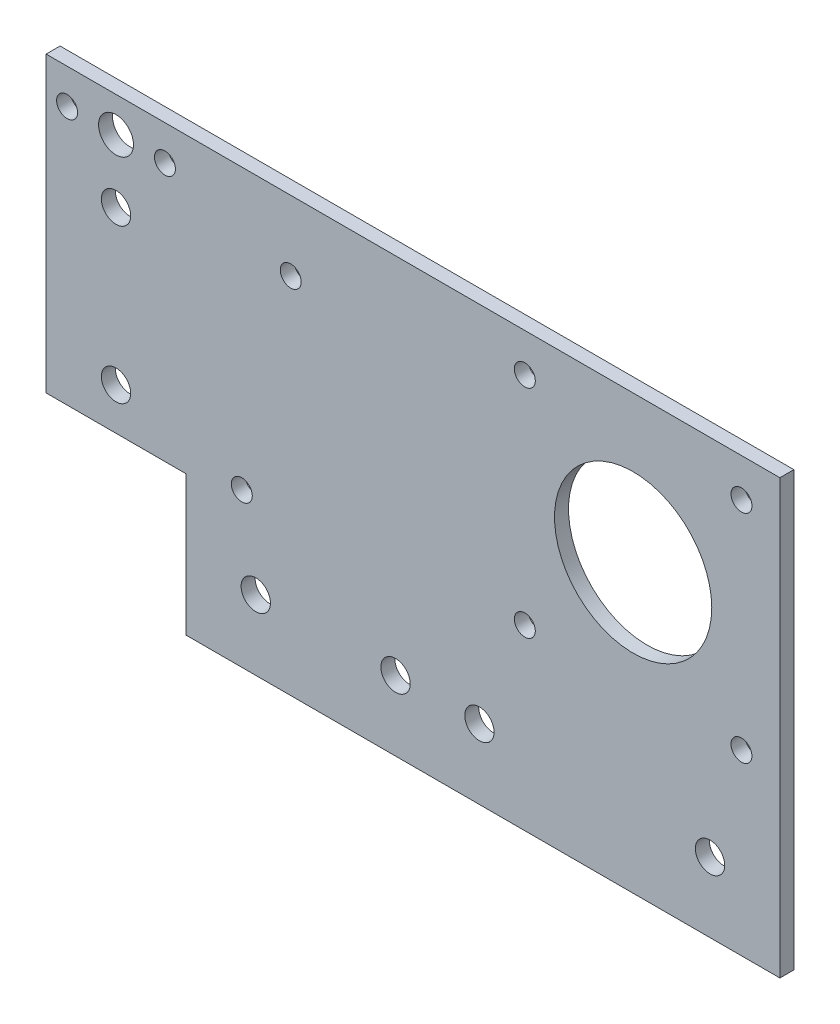
ISO-10303-21;
HEADER;
FILE_DESCRIPTION(('STEP AP214'),'2;1');
FILE_NAME('part.step','',(''),(''),'','','');
FILE_SCHEMA(('AUTOMOTIVE_DESIGN { 1 0 10303 214 1 1 1 1 }'));
ENDSEC;
DATA;
#1=APPLICATION_CONTEXT('core data for automotive mechanical design processes');
#2=APPLICATION_PROTOCOL_DEFINITION('international standard','automotive_design',2000,#1);
#3=PRODUCT_CONTEXT('',#1,'mechanical');
#4=PRODUCT('Part','Part','',(#3));
#5=PRODUCT_RELATED_PRODUCT_CATEGORY('part','',(#4));
#6=PRODUCT_DEFINITION_FORMATION('','',#4);
#7=PRODUCT_DEFINITION_CONTEXT('part definition',#1,'design');
#8=PRODUCT_DEFINITION('design','',#6,#7);
#9=PRODUCT_DEFINITION_SHAPE('','',#8);
#10=(LENGTH_UNIT() NAMED_UNIT(*) SI_UNIT(.MILLI.,.METRE.));
#11=(NAMED_UNIT(*) PLANE_ANGLE_UNIT() SI_UNIT($,.RADIAN.));
#12=(NAMED_UNIT(*) SI_UNIT($,.STERADIAN.) SOLID_ANGLE_UNIT());
#13=UNCERTAINTY_MEASURE_WITH_UNIT(LENGTH_MEASURE(1.E-05),#10,'distance_accuracy_value','');
#14=(GEOMETRIC_REPRESENTATION_CONTEXT(3) GLOBAL_UNCERTAINTY_ASSIGNED_CONTEXT((#13)) GLOBAL_UNIT_ASSIGNED_CONTEXT((#10,
#11,#12)) REPRESENTATION_CONTEXT('',''));
#15=CARTESIAN_POINT('',(0.,0.,0.));
#16=DIRECTION('',(0.,0.,1.));
#17=DIRECTION('',(1.,0.,0.));
#18=AXIS2_PLACEMENT_3D('',#15,#16,#17);
#19=CARTESIAN_POINT('',(0.,0.,2.));
#20=DIRECTION('',(0.,0.,-1.));
#21=DIRECTION('',(-1.,0.,0.));
#22=AXIS2_PLACEMENT_3D('',#19,#20,#21);
#23=PLANE('',#22);
#24=CARTESIAN_POINT('',(50.,-10.,2.));
#25=DIRECTION('',(0.,0.,1.));
#26=DIRECTION('',(1.,0.,0.));
#27=AXIS2_PLACEMENT_3D('',#24,#25,#26);
#28=CIRCLE('',#27,2.1);
#29=CARTESIAN_POINT('',(52.1,-10.,2.));
#30=VERTEX_POINT('',#29);
#31=EDGE_CURVE('E250',#30,#30,#28,.T.);
#32=ORIENTED_EDGE('',*,*,#31,.F.);
#33=EDGE_LOOP('',(#32));
#34=FACE_BOUND('',#33,.T.);
#35=CARTESIAN_POINT('',(95.,-10.,2.));
#36=DIRECTION('',(0.,0.,1.));
#37=DIRECTION('',(1.,0.,0.));
#38=AXIS2_PLACEMENT_3D('',#35,#36,#37);
#39=CIRCLE('',#38,2.1);
#40=CARTESIAN_POINT('',(97.1,-10.,2.));
#41=VERTEX_POINT('',#40);
#42=EDGE_CURVE('E262',#41,#41,#39,.T.);
#43=ORIENTED_EDGE('',*,*,#42,.F.);
#44=EDGE_LOOP('',(#43));
#45=FACE_BOUND('',#44,.T.);
#46=CARTESIAN_POINT('',(10.,6.,2.));
#47=DIRECTION('',(0.,0.,1.));
#48=DIRECTION('',(1.,0.,0.));
#49=AXIS2_PLACEMENT_3D('',#46,#47,#48);
#50=CIRCLE('',#49,2.1);
#51=CARTESIAN_POINT('',(12.1,6.,2.));
#52=VERTEX_POINT('',#51);
#53=EDGE_CURVE('E274',#52,#52,#50,.T.);
#54=ORIENTED_EDGE('',*,*,#53,.F.);
#55=EDGE_LOOP('',(#54));
#56=FACE_BOUND('',#55,.T.);
#57=CARTESIAN_POINT('',(28.,2.,2.));
#58=DIRECTION('',(0.,0.,1.));
#59=DIRECTION('',(1.,0.,0.));
#60=AXIS2_PLACEMENT_3D('',#57,#58,#59);
#61=CIRCLE('',#60,1.5);
#62=CARTESIAN_POINT('',(29.5,2.,2.));
#63=VERTEX_POINT('',#62);
#64=EDGE_CURVE('E286',#63,#63,#61,.T.);
#65=ORIENTED_EDGE('',*,*,#64,.F.);
#66=EDGE_LOOP('',(#65));
#67=FACE_BOUND('',#66,.T.);
#68=CARTESIAN_POINT('',(99.5,5.50000000000001,2.));
#69=DIRECTION('',(0.,0.,1.));
#70=DIRECTION('',(1.,0.,0.));
#71=AXIS2_PLACEMENT_3D('',#68,#69,#70);
#72=CIRCLE('',#71,1.5);
#73=CARTESIAN_POINT('',(101.,5.50000000000001,2.));
#74=VERTEX_POINT('',#73);
#75=EDGE_CURVE('E298',#74,#74,#72,.T.);
#76=ORIENTED_EDGE('',*,*,#75,.F.);
#77=EDGE_LOOP('',(#76));
#78=FACE_BOUND('',#77,.T.);
#79=CARTESIAN_POINT('',(68.5,36.5,2.));
#80=DIRECTION('',(0.,0.,1.));
#81=DIRECTION('',(1.,0.,0.));
#82=AXIS2_PLACEMENT_3D('',#79,#80,#81);
#83=CIRCLE('',#82,1.5);
#84=CARTESIAN_POINT('',(70.,36.5,2.));
#85=VERTEX_POINT('',#84);
#86=EDGE_CURVE('E310',#85,#85,#83,.T.);
#87=ORIENTED_EDGE('',*,*,#86,.F.);
#88=EDGE_LOOP('',(#87));
#89=FACE_BOUND('',#88,.T.);
#90=CARTESIAN_POINT('',(84.,21.,2.));
#91=DIRECTION('',(0.,0.,1.));
#92=DIRECTION('',(1.,0.,0.));
#93=AXIS2_PLACEMENT_3D('',#90,#91,#92);
#94=CIRCLE('',#93,11.25);
#95=CARTESIAN_POINT('',(95.25,21.,2.));
#96=VERTEX_POINT('',#95);
#97=EDGE_CURVE('E322',#96,#96,#94,.T.);
#98=ORIENTED_EDGE('',*,*,#97,.F.);
#99=EDGE_LOOP('',(#98));
#100=FACE_BOUND('',#99,.T.);
#101=CARTESIAN_POINT('',(3.,37.,2.));
#102=DIRECTION('',(0.,0.,1.));
#103=DIRECTION('',(1.,0.,0.));
#104=AXIS2_PLACEMENT_3D('',#101,#102,#103);
#105=CIRCLE('',#104,1.5);
#106=CARTESIAN_POINT('',(4.5,37.,2.));
#107=VERTEX_POINT('',#106);
#108=EDGE_CURVE('E134',#107,#107,#105,.T.);
#109=ORIENTED_EDGE('',*,*,#108,.F.);
#110=EDGE_LOOP('',(#109));
#111=FACE_BOUND('',#110,.T.);
#112=DIRECTION('',(0.,1.,0.));
#113=VECTOR('',#112,1.);
#114=CARTESIAN_POINT('',(105.,-20.,2.));
#115=LINE('',#114,#113);
#116=CARTESIAN_POINT('',(105.,-20.,2.));
#117=VERTEX_POINT('',#116);
#118=CARTESIAN_POINT('',(105.,42.,2.));
#119=VERTEX_POINT('',#118);
#120=EDGE_CURVE('E141',#117,#119,#115,.T.);
#121=ORIENTED_EDGE('',*,*,#120,.T.);
#122=DIRECTION('',(-1.,0.,0.));
#123=VECTOR('',#122,1.);
#124=CARTESIAN_POINT('',(0.,42.,2.));
#125=LINE('',#124,#123);
#126=CARTESIAN_POINT('',(0.,42.,2.));
#127=VERTEX_POINT('',#126);
#128=EDGE_CURVE('E99',#119,#127,#125,.T.);
#129=ORIENTED_EDGE('',*,*,#128,.T.);
#130=DIRECTION('',(0.,-1.,0.));
#131=VECTOR('',#130,1.);
#132=CARTESIAN_POINT('',(0.,0.,2.));
#133=LINE('',#132,#131);
#134=CARTESIAN_POINT('',(0.,0.,2.));
#135=VERTEX_POINT('',#134);
#136=EDGE_CURVE('E112',#127,#135,#133,.T.);
#137=ORIENTED_EDGE('',*,*,#136,.T.);
#138=DIRECTION('',(1.,0.,0.));
#139=VECTOR('',#138,1.);
#140=CARTESIAN_POINT('',(0.,0.,2.));
#141=LINE('',#140,#139);
#142=CARTESIAN_POINT('',(20.,0.,2.));
#143=VERTEX_POINT('',#142);
#144=EDGE_CURVE('E106',#135,#143,#141,.T.);
#145=ORIENTED_EDGE('',*,*,#144,.T.);
#146=DIRECTION('',(0.,-1.,0.));
#147=VECTOR('',#146,1.);
#148=CARTESIAN_POINT('',(20.,0.,2.));
#149=LINE('',#148,#147);
#150=CARTESIAN_POINT('',(20.,-20.,2.));
#151=VERTEX_POINT('',#150);
#152=EDGE_CURVE('E110',#143,#151,#149,.T.);
#153=ORIENTED_EDGE('',*,*,#152,.T.);
#154=DIRECTION('',(1.,0.,0.));
#155=VECTOR('',#154,1.);
#156=CARTESIAN_POINT('',(20.,-20.,2.));
#157=LINE('',#156,#155);
#158=EDGE_CURVE('E62',#151,#117,#157,.T.);
#159=ORIENTED_EDGE('',*,*,#158,.T.);
#160=EDGE_LOOP('',(#121,#129,#137,#145,#153,#159));
#161=FACE_BOUND('',#160,.T.);
#162=CARTESIAN_POINT('',(17.,37.,2.));
#163=DIRECTION('',(0.,0.,1.));
#164=DIRECTION('',(1.,0.,0.));
#165=AXIS2_PLACEMENT_3D('',#162,#163,#164);
#166=CIRCLE('',#165,1.5);
#167=CARTESIAN_POINT('',(18.5,37.,2.));
#168=VERTEX_POINT('',#167);
#169=EDGE_CURVE('E328',#168,#168,#166,.T.);
#170=ORIENTED_EDGE('',*,*,#169,.F.);
#171=EDGE_LOOP('',(#170));
#172=FACE_BOUND('',#171,.T.);
#173=CARTESIAN_POINT('',(99.5,36.5,2.));
#174=DIRECTION('',(0.,0.,1.));
#175=DIRECTION('',(1.,0.,0.));
#176=AXIS2_PLACEMENT_3D('',#173,#174,#175);
#177=CIRCLE('',#176,1.5);
#178=CARTESIAN_POINT('',(101.,36.5,2.));
#179=VERTEX_POINT('',#178);
#180=EDGE_CURVE('E316',#179,#179,#177,.T.);
#181=ORIENTED_EDGE('',*,*,#180,.F.);
#182=EDGE_LOOP('',(#181));
#183=FACE_BOUND('',#182,.T.);
#184=CARTESIAN_POINT('',(68.5,5.50000000000001,2.));
#185=DIRECTION('',(0.,0.,1.));
#186=DIRECTION('',(1.,0.,0.));
#187=AXIS2_PLACEMENT_3D('',#184,#185,#186);
#188=CIRCLE('',#187,1.5);
#189=CARTESIAN_POINT('',(70.,5.50000000000001,2.));
#190=VERTEX_POINT('',#189);
#191=EDGE_CURVE('E304',#190,#190,#188,.T.);
#192=ORIENTED_EDGE('',*,*,#191,.F.);
#193=EDGE_LOOP('',(#192));
#194=FACE_BOUND('',#193,.T.);
#195=CARTESIAN_POINT('',(35.,32.,2.));
#196=DIRECTION('',(0.,0.,1.));
#197=DIRECTION('',(1.,0.,0.));
#198=AXIS2_PLACEMENT_3D('',#195,#196,#197);
#199=CIRCLE('',#198,1.5);
#200=CARTESIAN_POINT('',(36.5,32.,2.));
#201=VERTEX_POINT('',#200);
#202=EDGE_CURVE('E292',#201,#201,#199,.T.);
#203=ORIENTED_EDGE('',*,*,#202,.F.);
#204=EDGE_LOOP('',(#203));
#205=FACE_BOUND('',#204,.T.);
#206=CARTESIAN_POINT('',(10.,28.,2.));
#207=DIRECTION('',(0.,0.,1.));
#208=DIRECTION('',(1.,0.,0.));
#209=AXIS2_PLACEMENT_3D('',#206,#207,#208);
#210=CIRCLE('',#209,2.1);
#211=CARTESIAN_POINT('',(12.1,28.,2.));
#212=VERTEX_POINT('',#211);
#213=EDGE_CURVE('E280',#212,#212,#210,.T.);
#214=ORIENTED_EDGE('',*,*,#213,.F.);
#215=EDGE_LOOP('',(#214));
#216=FACE_BOUND('',#215,.T.);
#217=CARTESIAN_POINT('',(30.,-10.,2.));
#218=DIRECTION('',(0.,0.,1.));
#219=DIRECTION('',(1.,0.,0.));
#220=AXIS2_PLACEMENT_3D('',#217,#218,#219);
#221=CIRCLE('',#220,2.1);
#222=CARTESIAN_POINT('',(32.1,-10.,2.));
#223=VERTEX_POINT('',#222);
#224=EDGE_CURVE('E268',#223,#223,#221,.T.);
#225=ORIENTED_EDGE('',*,*,#224,.F.);
#226=EDGE_LOOP('',(#225));
#227=FACE_BOUND('',#226,.T.);
#228=CARTESIAN_POINT('',(10.,37.,2.));
#229=DIRECTION('',(0.,0.,1.));
#230=DIRECTION('',(1.,0.,0.));
#231=AXIS2_PLACEMENT_3D('',#228,#229,#230);
#232=CIRCLE('',#231,2.5);
#233=CARTESIAN_POINT('',(12.5,37.,2.));
#234=VERTEX_POINT('',#233);
#235=EDGE_CURVE('E256',#234,#234,#232,.T.);
#236=ORIENTED_EDGE('',*,*,#235,.F.);
#237=EDGE_LOOP('',(#236));
#238=FACE_BOUND('',#237,.T.);
#239=CARTESIAN_POINT('',(62.,-10.,2.));
#240=DIRECTION('',(0.,0.,1.));
#241=DIRECTION('',(1.,0.,0.));
#242=AXIS2_PLACEMENT_3D('',#239,#240,#241);
#243=CIRCLE('',#242,2.09999999999999);
#244=CARTESIAN_POINT('',(64.1,-10.,2.));
#245=VERTEX_POINT('',#244);
#246=EDGE_CURVE('E241',#245,#245,#243,.T.);
#247=ORIENTED_EDGE('',*,*,#246,.F.);
#248=EDGE_LOOP('',(#247));
#249=FACE_BOUND('',#248,.T.);
#250=ADVANCED_FACE('F45',(#34,#45,#56,#67,#78,#89,#100,#111,#161,#172,#183,#194,#205,#216,#227,
#238,#249),#23,.F.);
#251=CARTESIAN_POINT('',(0.,0.,0.));
#252=DIRECTION('',(0.,0.,-1.));
#253=DIRECTION('',(-1.,0.,0.));
#254=AXIS2_PLACEMENT_3D('',#251,#252,#253);
#255=PLANE('',#254);
#256=CARTESIAN_POINT('',(50.,-10.,0.));
#257=DIRECTION('',(0.,0.,1.));
#258=DIRECTION('',(1.,0.,0.));
#259=AXIS2_PLACEMENT_3D('',#256,#257,#258);
#260=CIRCLE('',#259,2.1);
#261=CARTESIAN_POINT('',(52.1,-10.,0.));
#262=VERTEX_POINT('',#261);
#263=EDGE_CURVE('E247',#262,#262,#260,.T.);
#264=ORIENTED_EDGE('',*,*,#263,.T.);
#265=EDGE_LOOP('',(#264));
#266=FACE_BOUND('',#265,.T.);
#267=CARTESIAN_POINT('',(95.,-10.,0.));
#268=DIRECTION('',(0.,0.,1.));
#269=DIRECTION('',(1.,0.,0.));
#270=AXIS2_PLACEMENT_3D('',#267,#268,#269);
#271=CIRCLE('',#270,2.1);
#272=CARTESIAN_POINT('',(97.1,-10.,0.));
#273=VERTEX_POINT('',#272);
#274=EDGE_CURVE('E259',#273,#273,#271,.T.);
#275=ORIENTED_EDGE('',*,*,#274,.T.);
#276=EDGE_LOOP('',(#275));
#277=FACE_BOUND('',#276,.T.);
#278=CARTESIAN_POINT('',(10.,6.,0.));
#279=DIRECTION('',(0.,0.,1.));
#280=DIRECTION('',(1.,0.,0.));
#281=AXIS2_PLACEMENT_3D('',#278,#279,#280);
#282=CIRCLE('',#281,2.1);
#283=CARTESIAN_POINT('',(12.1,6.,0.));
#284=VERTEX_POINT('',#283);
#285=EDGE_CURVE('E271',#284,#284,#282,.T.);
#286=ORIENTED_EDGE('',*,*,#285,.T.);
#287=EDGE_LOOP('',(#286));
#288=FACE_BOUND('',#287,.T.);
#289=CARTESIAN_POINT('',(28.,2.,0.));
#290=DIRECTION('',(0.,0.,1.));
#291=DIRECTION('',(1.,0.,0.));
#292=AXIS2_PLACEMENT_3D('',#289,#290,#291);
#293=CIRCLE('',#292,1.5);
#294=CARTESIAN_POINT('',(29.5,2.,0.));
#295=VERTEX_POINT('',#294);
#296=EDGE_CURVE('E283',#295,#295,#293,.T.);
#297=ORIENTED_EDGE('',*,*,#296,.T.);
#298=EDGE_LOOP('',(#297));
#299=FACE_BOUND('',#298,.T.);
#300=CARTESIAN_POINT('',(99.5,5.50000000000001,0.));
#301=DIRECTION('',(0.,0.,1.));
#302=DIRECTION('',(1.,0.,0.));
#303=AXIS2_PLACEMENT_3D('',#300,#301,#302);
#304=CIRCLE('',#303,1.5);
#305=CARTESIAN_POINT('',(101.,5.50000000000001,0.));
#306=VERTEX_POINT('',#305);
#307=EDGE_CURVE('E295',#306,#306,#304,.T.);
#308=ORIENTED_EDGE('',*,*,#307,.T.);
#309=EDGE_LOOP('',(#308));
#310=FACE_BOUND('',#309,.T.);
#311=CARTESIAN_POINT('',(68.5,36.5,0.));
#312=DIRECTION('',(0.,0.,1.));
#313=DIRECTION('',(1.,0.,0.));
#314=AXIS2_PLACEMENT_3D('',#311,#312,#313);
#315=CIRCLE('',#314,1.5);
#316=CARTESIAN_POINT('',(70.,36.5,0.));
#317=VERTEX_POINT('',#316);
#318=EDGE_CURVE('E307',#317,#317,#315,.T.);
#319=ORIENTED_EDGE('',*,*,#318,.T.);
#320=EDGE_LOOP('',(#319));
#321=FACE_BOUND('',#320,.T.);
#322=CARTESIAN_POINT('',(84.,21.,0.));
#323=DIRECTION('',(0.,0.,1.));
#324=DIRECTION('',(1.,0.,0.));
#325=AXIS2_PLACEMENT_3D('',#322,#323,#324);
#326=CIRCLE('',#325,11.25);
#327=CARTESIAN_POINT('',(95.25,21.,0.));
#328=VERTEX_POINT('',#327);
#329=EDGE_CURVE('E319',#328,#328,#326,.T.);
#330=ORIENTED_EDGE('',*,*,#329,.T.);
#331=EDGE_LOOP('',(#330));
#332=FACE_BOUND('',#331,.T.);
#333=CARTESIAN_POINT('',(3.,37.,0.));
#334=DIRECTION('',(0.,0.,1.));
#335=DIRECTION('',(1.,0.,0.));
#336=AXIS2_PLACEMENT_3D('',#333,#334,#335);
#337=CIRCLE('',#336,1.5);
#338=CARTESIAN_POINT('',(4.5,37.,0.));
#339=VERTEX_POINT('',#338);
#340=EDGE_CURVE('E331',#339,#339,#337,.T.);
#341=ORIENTED_EDGE('',*,*,#340,.T.);
#342=EDGE_LOOP('',(#341));
#343=FACE_BOUND('',#342,.T.);
#344=DIRECTION('',(0.,1.,0.));
#345=VECTOR('',#344,1.);
#346=CARTESIAN_POINT('',(105.,-20.,0.));
#347=LINE('',#346,#345);
#348=CARTESIAN_POINT('',(105.,-20.,0.));
#349=VERTEX_POINT('',#348);
#350=CARTESIAN_POINT('',(105.,42.,0.));
#351=VERTEX_POINT('',#350);
#352=EDGE_CURVE('E130',#349,#351,#347,.T.);
#353=ORIENTED_EDGE('',*,*,#352,.F.);
#354=DIRECTION('',(1.,0.,0.));
#355=VECTOR('',#354,1.);
#356=CARTESIAN_POINT('',(20.,-20.,0.));
#357=LINE('',#356,#355);
#358=CARTESIAN_POINT('',(20.,-20.,0.));
#359=VERTEX_POINT('',#358);
#360=EDGE_CURVE('E91',#359,#349,#357,.T.);
#361=ORIENTED_EDGE('',*,*,#360,.F.);
#362=DIRECTION('',(0.,-1.,0.));
#363=VECTOR('',#362,1.);
#364=CARTESIAN_POINT('',(20.,0.,0.));
#365=LINE('',#364,#363);
#366=CARTESIAN_POINT('',(20.,0.,0.));
#367=VERTEX_POINT('',#366);
#368=EDGE_CURVE('E85',#367,#359,#365,.T.);
#369=ORIENTED_EDGE('',*,*,#368,.F.);
#370=DIRECTION('',(1.,0.,0.));
#371=VECTOR('',#370,1.);
#372=CARTESIAN_POINT('',(0.,0.,0.));
#373=LINE('',#372,#371);
#374=CARTESIAN_POINT('',(0.,0.,0.));
#375=VERTEX_POINT('',#374);
#376=EDGE_CURVE('E120',#375,#367,#373,.T.);
#377=ORIENTED_EDGE('',*,*,#376,.F.);
#378=DIRECTION('',(0.,-1.,0.));
#379=VECTOR('',#378,1.);
#380=CARTESIAN_POINT('',(0.,0.,0.));
#381=LINE('',#380,#379);
#382=CARTESIAN_POINT('',(0.,42.,0.));
#383=VERTEX_POINT('',#382);
#384=EDGE_CURVE('E136',#383,#375,#381,.T.);
#385=ORIENTED_EDGE('',*,*,#384,.F.);
#386=DIRECTION('',(-1.,0.,0.));
#387=VECTOR('',#386,1.);
#388=CARTESIAN_POINT('',(0.,42.,0.));
#389=LINE('',#388,#387);
#390=EDGE_CURVE('E133',#351,#383,#389,.T.);
#391=ORIENTED_EDGE('',*,*,#390,.F.);
#392=EDGE_LOOP('',(#353,#361,#369,#377,#385,#391));
#393=FACE_BOUND('',#392,.T.);
#394=CARTESIAN_POINT('',(17.,37.,0.));
#395=DIRECTION('',(0.,0.,1.));
#396=DIRECTION('',(1.,0.,0.));
#397=AXIS2_PLACEMENT_3D('',#394,#395,#396);
#398=CIRCLE('',#397,1.5);
#399=CARTESIAN_POINT('',(18.5,37.,0.));
#400=VERTEX_POINT('',#399);
#401=EDGE_CURVE('E325',#400,#400,#398,.T.);
#402=ORIENTED_EDGE('',*,*,#401,.T.);
#403=EDGE_LOOP('',(#402));
#404=FACE_BOUND('',#403,.T.);
#405=CARTESIAN_POINT('',(99.5,36.5,0.));
#406=DIRECTION('',(0.,0.,1.));
#407=DIRECTION('',(1.,0.,0.));
#408=AXIS2_PLACEMENT_3D('',#405,#406,#407);
#409=CIRCLE('',#408,1.5);
#410=CARTESIAN_POINT('',(101.,36.5,0.));
#411=VERTEX_POINT('',#410);
#412=EDGE_CURVE('E313',#411,#411,#409,.T.);
#413=ORIENTED_EDGE('',*,*,#412,.T.);
#414=EDGE_LOOP('',(#413));
#415=FACE_BOUND('',#414,.T.);
#416=CARTESIAN_POINT('',(68.5,5.50000000000001,0.));
#417=DIRECTION('',(0.,0.,1.));
#418=DIRECTION('',(1.,0.,0.));
#419=AXIS2_PLACEMENT_3D('',#416,#417,#418);
#420=CIRCLE('',#419,1.5);
#421=CARTESIAN_POINT('',(70.,5.50000000000001,0.));
#422=VERTEX_POINT('',#421);
#423=EDGE_CURVE('E301',#422,#422,#420,.T.);
#424=ORIENTED_EDGE('',*,*,#423,.T.);
#425=EDGE_LOOP('',(#424));
#426=FACE_BOUND('',#425,.T.);
#427=CARTESIAN_POINT('',(35.,32.,0.));
#428=DIRECTION('',(0.,0.,1.));
#429=DIRECTION('',(1.,0.,0.));
#430=AXIS2_PLACEMENT_3D('',#427,#428,#429);
#431=CIRCLE('',#430,1.5);
#432=CARTESIAN_POINT('',(36.5,32.,0.));
#433=VERTEX_POINT('',#432);
#434=EDGE_CURVE('E289',#433,#433,#431,.T.);
#435=ORIENTED_EDGE('',*,*,#434,.T.);
#436=EDGE_LOOP('',(#435));
#437=FACE_BOUND('',#436,.T.);
#438=CARTESIAN_POINT('',(10.,28.,0.));
#439=DIRECTION('',(0.,0.,1.));
#440=DIRECTION('',(1.,0.,0.));
#441=AXIS2_PLACEMENT_3D('',#438,#439,#440);
#442=CIRCLE('',#441,2.1);
#443=CARTESIAN_POINT('',(12.1,28.,0.));
#444=VERTEX_POINT('',#443);
#445=EDGE_CURVE('E277',#444,#444,#442,.T.);
#446=ORIENTED_EDGE('',*,*,#445,.T.);
#447=EDGE_LOOP('',(#446));
#448=FACE_BOUND('',#447,.T.);
#449=CARTESIAN_POINT('',(30.,-10.,0.));
#450=DIRECTION('',(0.,0.,1.));
#451=DIRECTION('',(1.,0.,0.));
#452=AXIS2_PLACEMENT_3D('',#449,#450,#451);
#453=CIRCLE('',#452,2.1);
#454=CARTESIAN_POINT('',(32.1,-10.,0.));
#455=VERTEX_POINT('',#454);
#456=EDGE_CURVE('E265',#455,#455,#453,.T.);
#457=ORIENTED_EDGE('',*,*,#456,.T.);
#458=EDGE_LOOP('',(#457));
#459=FACE_BOUND('',#458,.T.);
#460=CARTESIAN_POINT('',(10.,37.,0.));
#461=DIRECTION('',(0.,0.,1.));
#462=DIRECTION('',(1.,0.,0.));
#463=AXIS2_PLACEMENT_3D('',#460,#461,#462);
#464=CIRCLE('',#463,2.5);
#465=CARTESIAN_POINT('',(12.5,37.,0.));
#466=VERTEX_POINT('',#465);
#467=EDGE_CURVE('E253',#466,#466,#464,.T.);
#468=ORIENTED_EDGE('',*,*,#467,.T.);
#469=EDGE_LOOP('',(#468));
#470=FACE_BOUND('',#469,.T.);
#471=CARTESIAN_POINT('',(62.,-10.,0.));
#472=DIRECTION('',(0.,0.,1.));
#473=DIRECTION('',(1.,0.,0.));
#474=AXIS2_PLACEMENT_3D('',#471,#472,#473);
#475=CIRCLE('',#474,2.09999999999999);
#476=CARTESIAN_POINT('',(64.1,-10.,0.));
#477=VERTEX_POINT('',#476);
#478=EDGE_CURVE('E244',#477,#477,#475,.T.);
#479=ORIENTED_EDGE('',*,*,#478,.T.);
#480=EDGE_LOOP('',(#479));
#481=FACE_BOUND('',#480,.T.);
#482=ADVANCED_FACE('F150',(#266,#277,#288,#299,#310,#321,#332,#343,#393,#404,#415,#426,#437,
#448,#459,#470,#481),#255,.T.);
#483=CARTESIAN_POINT('',(105.,-20.,2.));
#484=DIRECTION('',(-1.,0.,0.));
#485=DIRECTION('',(0.,0.,1.));
#486=AXIS2_PLACEMENT_3D('',#483,#484,#485);
#487=PLANE('',#486);
#488=ORIENTED_EDGE('',*,*,#352,.T.);
#489=DIRECTION('',(0.,0.,-1.));
#490=VECTOR('',#489,1.);
#491=CARTESIAN_POINT('',(105.,42.,2.));
#492=LINE('',#491,#490);
#493=EDGE_CURVE('E13',#119,#351,#492,.T.);
#494=ORIENTED_EDGE('',*,*,#493,.F.);
#495=ORIENTED_EDGE('',*,*,#120,.F.);
#496=DIRECTION('',(0.,0.,-1.));
#497=VECTOR('',#496,1.);
#498=CARTESIAN_POINT('',(105.,-20.,2.));
#499=LINE('',#498,#497);
#500=EDGE_CURVE('E126',#117,#349,#499,.T.);
#501=ORIENTED_EDGE('',*,*,#500,.T.);
#502=EDGE_LOOP('',(#488,#494,#495,#501));
#503=FACE_BOUND('',#502,.T.);
#504=ADVANCED_FACE('F47',(#503),#487,.F.);
#505=CARTESIAN_POINT('',(0.,42.,2.));
#506=DIRECTION('',(0.,-1.,0.));
#507=DIRECTION('',(0.,0.,-1.));
#508=AXIS2_PLACEMENT_3D('',#505,#506,#507);
#509=PLANE('',#508);
#510=ORIENTED_EDGE('',*,*,#390,.T.);
#511=DIRECTION('',(0.,0.,-1.));
#512=VECTOR('',#511,1.);
#513=CARTESIAN_POINT('',(0.,42.,2.));
#514=LINE('',#513,#512);
#515=EDGE_CURVE('E54',#127,#383,#514,.T.);
#516=ORIENTED_EDGE('',*,*,#515,.F.);
#517=ORIENTED_EDGE('',*,*,#128,.F.);
#518=ORIENTED_EDGE('',*,*,#493,.T.);
#519=EDGE_LOOP('',(#510,#516,#517,#518));
#520=FACE_BOUND('',#519,.T.);
#521=ADVANCED_FACE('F496',(#520),#509,.F.);
#522=CARTESIAN_POINT('',(0.,0.,2.));
#523=DIRECTION('',(1.,0.,0.));
#524=DIRECTION('',(0.,0.,-1.));
#525=AXIS2_PLACEMENT_3D('',#522,#523,#524);
#526=PLANE('',#525);
#527=ORIENTED_EDGE('',*,*,#384,.T.);
#528=DIRECTION('',(0.,0.,-1.));
#529=VECTOR('',#528,1.);
#530=CARTESIAN_POINT('',(0.,0.,2.));
#531=LINE('',#530,#529);
#532=EDGE_CURVE('E121',#135,#375,#531,.T.);
#533=ORIENTED_EDGE('',*,*,#532,.F.);
#534=ORIENTED_EDGE('',*,*,#136,.F.);
#535=ORIENTED_EDGE('',*,*,#515,.T.);
#536=EDGE_LOOP('',(#527,#533,#534,#535));
#537=FACE_BOUND('',#536,.T.);
#538=ADVANCED_FACE('F147',(#537),#526,.F.);
#539=CARTESIAN_POINT('',(0.,0.,2.));
#540=DIRECTION('',(0.,1.,0.));
#541=DIRECTION('',(0.,0.,1.));
#542=AXIS2_PLACEMENT_3D('',#539,#540,#541);
#543=PLANE('',#542);
#544=ORIENTED_EDGE('',*,*,#376,.T.);
#545=DIRECTION('',(0.,0.,-1.));
#546=VECTOR('',#545,1.);
#547=CARTESIAN_POINT('',(20.,0.,2.));
#548=LINE('',#547,#546);
#549=EDGE_CURVE('E117',#143,#367,#548,.T.);
#550=ORIENTED_EDGE('',*,*,#549,.F.);
#551=ORIENTED_EDGE('',*,*,#144,.F.);
#552=ORIENTED_EDGE('',*,*,#532,.T.);
#553=EDGE_LOOP('',(#544,#550,#551,#552));
#554=FACE_BOUND('',#553,.T.);
#555=ADVANCED_FACE('F118',(#554),#543,.F.);
#556=CARTESIAN_POINT('',(20.,0.,2.));
#557=DIRECTION('',(1.,0.,0.));
#558=DIRECTION('',(0.,1.,0.));
#559=AXIS2_PLACEMENT_3D('',#556,#557,#558);
#560=PLANE('',#559);
#561=ORIENTED_EDGE('',*,*,#368,.T.);
#562=DIRECTION('',(0.,0.,-1.));
#563=VECTOR('',#562,1.);
#564=CARTESIAN_POINT('',(20.,-20.,2.));
#565=LINE('',#564,#563);
#566=EDGE_CURVE('E122',#151,#359,#565,.T.);
#567=ORIENTED_EDGE('',*,*,#566,.F.);
#568=ORIENTED_EDGE('',*,*,#152,.F.);
#569=ORIENTED_EDGE('',*,*,#549,.T.);
#570=EDGE_LOOP('',(#561,#567,#568,#569));
#571=FACE_BOUND('',#570,.T.);
#572=ADVANCED_FACE('F124',(#571),#560,.F.);
#573=CARTESIAN_POINT('',(20.,-20.,2.));
#574=DIRECTION('',(0.,1.,0.));
#575=DIRECTION('',(0.,0.,1.));
#576=AXIS2_PLACEMENT_3D('',#573,#574,#575);
#577=PLANE('',#576);
#578=ORIENTED_EDGE('',*,*,#360,.T.);
#579=ORIENTED_EDGE('',*,*,#500,.F.);
#580=ORIENTED_EDGE('',*,*,#158,.F.);
#581=ORIENTED_EDGE('',*,*,#566,.T.);
#582=EDGE_LOOP('',(#578,#579,#580,#581));
#583=FACE_BOUND('',#582,.T.);
#584=ADVANCED_FACE('F155',(#583),#577,.F.);
#585=CARTESIAN_POINT('',(3.,37.,2.));
#586=DIRECTION('',(0.,0.,-1.));
#587=DIRECTION('',(-1.,0.,0.));
#588=AXIS2_PLACEMENT_3D('',#585,#586,#587);
#589=CYLINDRICAL_SURFACE('',#588,1.5);
#590=ORIENTED_EDGE('',*,*,#108,.T.);
#591=EDGE_LOOP('',(#590));
#592=FACE_BOUND('',#591,.T.);
#593=ORIENTED_EDGE('',*,*,#340,.F.);
#594=EDGE_LOOP('',(#593));
#595=FACE_BOUND('',#594,.T.);
#596=ADVANCED_FACE('F157',(#592,#595),#589,.F.);
#597=CARTESIAN_POINT('',(17.,37.,2.));
#598=DIRECTION('',(0.,0.,-1.));
#599=DIRECTION('',(-1.,0.,0.));
#600=AXIS2_PLACEMENT_3D('',#597,#598,#599);
#601=CYLINDRICAL_SURFACE('',#600,1.5);
#602=ORIENTED_EDGE('',*,*,#169,.T.);
#603=EDGE_LOOP('',(#602));
#604=FACE_BOUND('',#603,.T.);
#605=ORIENTED_EDGE('',*,*,#401,.F.);
#606=EDGE_LOOP('',(#605));
#607=FACE_BOUND('',#606,.T.);
#608=ADVANCED_FACE('F163',(#604,#607),#601,.F.);
#609=CARTESIAN_POINT('',(84.,21.,2.));
#610=DIRECTION('',(0.,0.,-1.));
#611=DIRECTION('',(-1.,0.,0.));
#612=AXIS2_PLACEMENT_3D('',#609,#610,#611);
#613=CYLINDRICAL_SURFACE('',#612,11.25);
#614=ORIENTED_EDGE('',*,*,#97,.T.);
#615=EDGE_LOOP('',(#614));
#616=FACE_BOUND('',#615,.T.);
#617=ORIENTED_EDGE('',*,*,#329,.F.);
#618=EDGE_LOOP('',(#617));
#619=FACE_BOUND('',#618,.T.);
#620=ADVANCED_FACE('F180',(#616,#619),#613,.F.);
#621=CARTESIAN_POINT('',(99.5,36.5,2.));
#622=DIRECTION('',(0.,0.,-1.));
#623=DIRECTION('',(-1.,0.,0.));
#624=AXIS2_PLACEMENT_3D('',#621,#622,#623);
#625=CYLINDRICAL_SURFACE('',#624,1.5);
#626=ORIENTED_EDGE('',*,*,#180,.T.);
#627=EDGE_LOOP('',(#626));
#628=FACE_BOUND('',#627,.T.);
#629=ORIENTED_EDGE('',*,*,#412,.F.);
#630=EDGE_LOOP('',(#629));
#631=FACE_BOUND('',#630,.T.);
#632=ADVANCED_FACE('F184',(#628,#631),#625,.F.);
#633=CARTESIAN_POINT('',(68.5,36.5,2.));
#634=DIRECTION('',(0.,0.,-1.));
#635=DIRECTION('',(-1.,0.,0.));
#636=AXIS2_PLACEMENT_3D('',#633,#634,#635);
#637=CYLINDRICAL_SURFACE('',#636,1.5);
#638=ORIENTED_EDGE('',*,*,#86,.T.);
#639=EDGE_LOOP('',(#638));
#640=FACE_BOUND('',#639,.T.);
#641=ORIENTED_EDGE('',*,*,#318,.F.);
#642=EDGE_LOOP('',(#641));
#643=FACE_BOUND('',#642,.T.);
#644=ADVANCED_FACE('F188',(#640,#643),#637,.F.);
#645=CARTESIAN_POINT('',(68.5,5.50000000000001,2.));
#646=DIRECTION('',(0.,0.,-1.));
#647=DIRECTION('',(-1.,0.,0.));
#648=AXIS2_PLACEMENT_3D('',#645,#646,#647);
#649=CYLINDRICAL_SURFACE('',#648,1.5);
#650=ORIENTED_EDGE('',*,*,#191,.T.);
#651=EDGE_LOOP('',(#650));
#652=FACE_BOUND('',#651,.T.);
#653=ORIENTED_EDGE('',*,*,#423,.F.);
#654=EDGE_LOOP('',(#653));
#655=FACE_BOUND('',#654,.T.);
#656=ADVANCED_FACE('F192',(#652,#655),#649,.F.);
#657=CARTESIAN_POINT('',(99.5,5.50000000000001,2.));
#658=DIRECTION('',(0.,0.,-1.));
#659=DIRECTION('',(-1.,0.,0.));
#660=AXIS2_PLACEMENT_3D('',#657,#658,#659);
#661=CYLINDRICAL_SURFACE('',#660,1.5);
#662=ORIENTED_EDGE('',*,*,#75,.T.);
#663=EDGE_LOOP('',(#662));
#664=FACE_BOUND('',#663,.T.);
#665=ORIENTED_EDGE('',*,*,#307,.F.);
#666=EDGE_LOOP('',(#665));
#667=FACE_BOUND('',#666,.T.);
#668=ADVANCED_FACE('F196',(#664,#667),#661,.F.);
#669=CARTESIAN_POINT('',(35.,32.,2.));
#670=DIRECTION('',(0.,0.,-1.));
#671=DIRECTION('',(-1.,0.,0.));
#672=AXIS2_PLACEMENT_3D('',#669,#670,#671);
#673=CYLINDRICAL_SURFACE('',#672,1.5);
#674=ORIENTED_EDGE('',*,*,#202,.T.);
#675=EDGE_LOOP('',(#674));
#676=FACE_BOUND('',#675,.T.);
#677=ORIENTED_EDGE('',*,*,#434,.F.);
#678=EDGE_LOOP('',(#677));
#679=FACE_BOUND('',#678,.T.);
#680=ADVANCED_FACE('F200',(#676,#679),#673,.F.);
#681=CARTESIAN_POINT('',(28.,2.,2.));
#682=DIRECTION('',(0.,0.,-1.));
#683=DIRECTION('',(-1.,0.,0.));
#684=AXIS2_PLACEMENT_3D('',#681,#682,#683);
#685=CYLINDRICAL_SURFACE('',#684,1.5);
#686=ORIENTED_EDGE('',*,*,#64,.T.);
#687=EDGE_LOOP('',(#686));
#688=FACE_BOUND('',#687,.T.);
#689=ORIENTED_EDGE('',*,*,#296,.F.);
#690=EDGE_LOOP('',(#689));
#691=FACE_BOUND('',#690,.T.);
#692=ADVANCED_FACE('F204',(#688,#691),#685,.F.);
#693=CARTESIAN_POINT('',(10.,28.,2.));
#694=DIRECTION('',(0.,0.,-1.));
#695=DIRECTION('',(-1.,0.,0.));
#696=AXIS2_PLACEMENT_3D('',#693,#694,#695);
#697=CYLINDRICAL_SURFACE('',#696,2.1);
#698=ORIENTED_EDGE('',*,*,#213,.T.);
#699=EDGE_LOOP('',(#698));
#700=FACE_BOUND('',#699,.T.);
#701=ORIENTED_EDGE('',*,*,#445,.F.);
#702=EDGE_LOOP('',(#701));
#703=FACE_BOUND('',#702,.T.);
#704=ADVANCED_FACE('F208',(#700,#703),#697,.F.);
#705=CARTESIAN_POINT('',(10.,6.,2.));
#706=DIRECTION('',(0.,0.,-1.));
#707=DIRECTION('',(-1.,0.,0.));
#708=AXIS2_PLACEMENT_3D('',#705,#706,#707);
#709=CYLINDRICAL_SURFACE('',#708,2.1);
#710=ORIENTED_EDGE('',*,*,#53,.T.);
#711=EDGE_LOOP('',(#710));
#712=FACE_BOUND('',#711,.T.);
#713=ORIENTED_EDGE('',*,*,#285,.F.);
#714=EDGE_LOOP('',(#713));
#715=FACE_BOUND('',#714,.T.);
#716=ADVANCED_FACE('F212',(#712,#715),#709,.F.);
#717=CARTESIAN_POINT('',(30.,-10.,2.));
#718=DIRECTION('',(0.,0.,-1.));
#719=DIRECTION('',(-1.,0.,0.));
#720=AXIS2_PLACEMENT_3D('',#717,#718,#719);
#721=CYLINDRICAL_SURFACE('',#720,2.1);
#722=ORIENTED_EDGE('',*,*,#224,.T.);
#723=EDGE_LOOP('',(#722));
#724=FACE_BOUND('',#723,.T.);
#725=ORIENTED_EDGE('',*,*,#456,.F.);
#726=EDGE_LOOP('',(#725));
#727=FACE_BOUND('',#726,.T.);
#728=ADVANCED_FACE('F216',(#724,#727),#721,.F.);
#729=CARTESIAN_POINT('',(95.,-10.,2.));
#730=DIRECTION('',(0.,0.,-1.));
#731=DIRECTION('',(-1.,0.,0.));
#732=AXIS2_PLACEMENT_3D('',#729,#730,#731);
#733=CYLINDRICAL_SURFACE('',#732,2.1);
#734=ORIENTED_EDGE('',*,*,#42,.T.);
#735=EDGE_LOOP('',(#734));
#736=FACE_BOUND('',#735,.T.);
#737=ORIENTED_EDGE('',*,*,#274,.F.);
#738=EDGE_LOOP('',(#737));
#739=FACE_BOUND('',#738,.T.);
#740=ADVANCED_FACE('F220',(#736,#739),#733,.F.);
#741=CARTESIAN_POINT('',(10.,37.,2.));
#742=DIRECTION('',(0.,0.,-1.));
#743=DIRECTION('',(-1.,0.,0.));
#744=AXIS2_PLACEMENT_3D('',#741,#742,#743);
#745=CYLINDRICAL_SURFACE('',#744,2.5);
#746=ORIENTED_EDGE('',*,*,#235,.T.);
#747=EDGE_LOOP('',(#746));
#748=FACE_BOUND('',#747,.T.);
#749=ORIENTED_EDGE('',*,*,#467,.F.);
#750=EDGE_LOOP('',(#749));
#751=FACE_BOUND('',#750,.T.);
#752=ADVANCED_FACE('F224',(#748,#751),#745,.F.);
#753=CARTESIAN_POINT('',(50.,-10.,2.));
#754=DIRECTION('',(0.,0.,-1.));
#755=DIRECTION('',(-1.,0.,0.));
#756=AXIS2_PLACEMENT_3D('',#753,#754,#755);
#757=CYLINDRICAL_SURFACE('',#756,2.1);
#758=ORIENTED_EDGE('',*,*,#31,.T.);
#759=EDGE_LOOP('',(#758));
#760=FACE_BOUND('',#759,.T.);
#761=ORIENTED_EDGE('',*,*,#263,.F.);
#762=EDGE_LOOP('',(#761));
#763=FACE_BOUND('',#762,.T.);
#764=ADVANCED_FACE('F228',(#760,#763),#757,.F.);
#765=CARTESIAN_POINT('',(62.,-10.,2.));
#766=DIRECTION('',(0.,0.,-1.));
#767=DIRECTION('',(-1.,0.,0.));
#768=AXIS2_PLACEMENT_3D('',#765,#766,#767);
#769=CYLINDRICAL_SURFACE('',#768,2.09999999999999);
#770=ORIENTED_EDGE('',*,*,#246,.T.);
#771=EDGE_LOOP('',(#770));
#772=FACE_BOUND('',#771,.T.);
#773=ORIENTED_EDGE('',*,*,#478,.F.);
#774=EDGE_LOOP('',(#773));
#775=FACE_BOUND('',#774,.T.);
#776=ADVANCED_FACE('F232',(#772,#775),#769,.F.);
#777=CLOSED_SHELL('',(#250,#482,#504,#521,#538,#555,#572,#584,#596,#608,#620,#632,#644,#656,
#668,#680,#692,#704,#716,#728,#740,#752,#764,#776));
#778=MANIFOLD_SOLID_BREP('B2',#777);
#779=ADVANCED_BREP_SHAPE_REPRESENTATION('',(#18,#778),#14);
#780=SHAPE_DEFINITION_REPRESENTATION(#9,#779);
ENDSEC;
END-ISO-10303-21;
